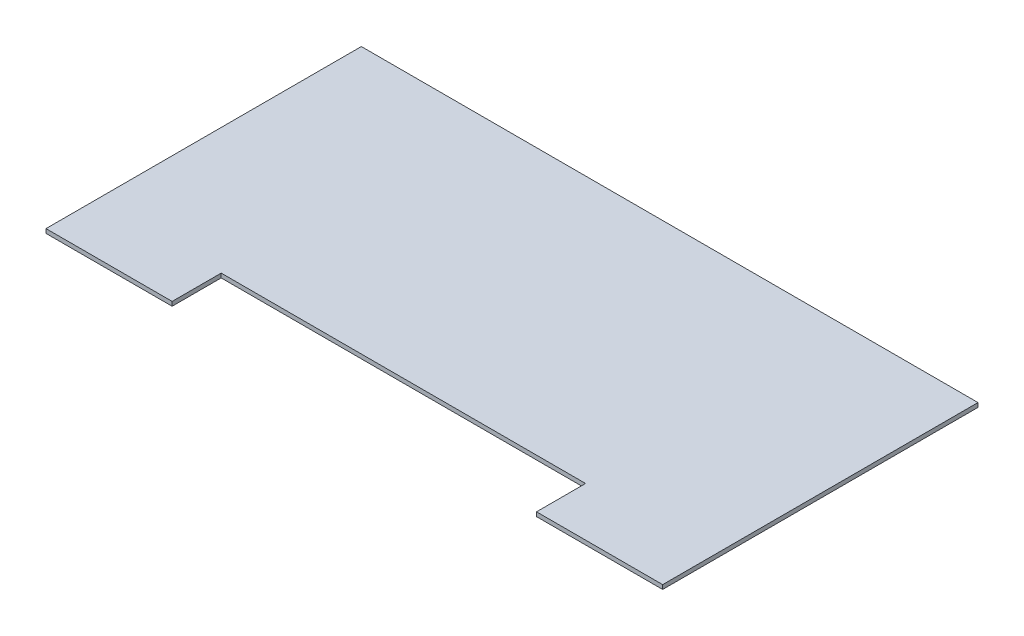
ISO-10303-21;
HEADER;
FILE_DESCRIPTION(('STEP AP214'),'2;1');
FILE_NAME('part.step','',(''),(''),'','','');
FILE_SCHEMA(('AUTOMOTIVE_DESIGN { 1 0 10303 214 1 1 1 1 }'));
ENDSEC;
DATA;
#1=APPLICATION_CONTEXT('core data for automotive mechanical design processes');
#2=APPLICATION_PROTOCOL_DEFINITION('international standard','automotive_design',2000,#1);
#3=PRODUCT_CONTEXT('',#1,'mechanical');
#4=PRODUCT('Part','Part','',(#3));
#5=PRODUCT_RELATED_PRODUCT_CATEGORY('part','',(#4));
#6=PRODUCT_DEFINITION_FORMATION('','',#4);
#7=PRODUCT_DEFINITION_CONTEXT('part definition',#1,'design');
#8=PRODUCT_DEFINITION('design','',#6,#7);
#9=PRODUCT_DEFINITION_SHAPE('','',#8);
#10=(LENGTH_UNIT() NAMED_UNIT(*) SI_UNIT(.MILLI.,.METRE.));
#11=(NAMED_UNIT(*) PLANE_ANGLE_UNIT() SI_UNIT($,.RADIAN.));
#12=(NAMED_UNIT(*) SI_UNIT($,.STERADIAN.) SOLID_ANGLE_UNIT());
#13=UNCERTAINTY_MEASURE_WITH_UNIT(LENGTH_MEASURE(1.E-05),#10,'distance_accuracy_value','');
#14=(GEOMETRIC_REPRESENTATION_CONTEXT(3) GLOBAL_UNCERTAINTY_ASSIGNED_CONTEXT((#13)) GLOBAL_UNIT_ASSIGNED_CONTEXT((#10,
#11,#12)) REPRESENTATION_CONTEXT('',''));
#15=CARTESIAN_POINT('',(0.,0.,0.));
#16=DIRECTION('',(0.,0.,1.));
#17=DIRECTION('',(1.,0.,0.));
#18=AXIS2_PLACEMENT_3D('',#15,#16,#17);
#19=CARTESIAN_POINT('',(0.,164.,0.));
#20=DIRECTION('',(0.,0.,1.));
#21=DIRECTION('',(1.,0.,0.));
#22=AXIS2_PLACEMENT_3D('',#19,#20,#21);
#23=PLANE('',#22);
#24=DIRECTION('',(0.,1.,0.));
#25=VECTOR('',#24,1.);
#26=CARTESIAN_POINT('',(350.,-3.001,0.));
#27=LINE('',#26,#25);
#28=CARTESIAN_POINT('',(350.,164.,0.));
#29=VERTEX_POINT('',#28);
#30=CARTESIAN_POINT('',(350.,167.,0.));
#31=VERTEX_POINT('',#30);
#32=EDGE_CURVE('E121',#29,#31,#27,.T.);
#33=ORIENTED_EDGE('',*,*,#32,.F.);
#34=DIRECTION('',(1.,0.,0.));
#35=VECTOR('',#34,1.);
#36=CARTESIAN_POINT('',(0.,164.,0.));
#37=LINE('',#36,#35);
#38=CARTESIAN_POINT('',(439.999999999999,164.,0.));
#39=VERTEX_POINT('',#38);
#40=EDGE_CURVE('E126',#29,#39,#37,.T.);
#41=ORIENTED_EDGE('',*,*,#40,.T.);
#42=DIRECTION('',(0.,1.,0.));
#43=VECTOR('',#42,1.);
#44=CARTESIAN_POINT('',(439.999999999999,164.,0.));
#45=LINE('',#44,#43);
#46=CARTESIAN_POINT('',(439.999999999999,167.,0.));
#47=VERTEX_POINT('',#46);
#48=EDGE_CURVE('E161',#39,#47,#45,.T.);
#49=ORIENTED_EDGE('',*,*,#48,.T.);
#50=DIRECTION('',(1.,0.,0.));
#51=VECTOR('',#50,1.);
#52=CARTESIAN_POINT('',(0.,167.,0.));
#53=LINE('',#52,#51);
#54=EDGE_CURVE('E152',#31,#47,#53,.T.);
#55=ORIENTED_EDGE('',*,*,#54,.F.);
#56=EDGE_LOOP('',(#33,#41,#49,#55));
#57=FACE_BOUND('',#56,.T.);
#58=ADVANCED_FACE('F32',(#57),#23,.T.);
#59=CARTESIAN_POINT('',(0.,164.,-225.));
#60=DIRECTION('',(-1.,0.,0.));
#61=DIRECTION('',(0.,0.,1.));
#62=AXIS2_PLACEMENT_3D('',#59,#60,#61);
#63=PLANE('',#62);
#64=DIRECTION('',(0.,0.,1.));
#65=VECTOR('',#64,1.);
#66=CARTESIAN_POINT('',(0.,167.,-225.));
#67=LINE('',#66,#65);
#68=CARTESIAN_POINT('',(0.,167.,-225.));
#69=VERTEX_POINT('',#68);
#70=CARTESIAN_POINT('',(0.,167.,0.));
#71=VERTEX_POINT('',#70);
#72=EDGE_CURVE('E120',#69,#71,#67,.T.);
#73=ORIENTED_EDGE('',*,*,#72,.F.);
#74=DIRECTION('',(0.,1.,0.));
#75=VECTOR('',#74,1.);
#76=CARTESIAN_POINT('',(0.,164.,-225.));
#77=LINE('',#76,#75);
#78=CARTESIAN_POINT('',(0.,164.,-225.));
#79=VERTEX_POINT('',#78);
#80=EDGE_CURVE('E11',#79,#69,#77,.T.);
#81=ORIENTED_EDGE('',*,*,#80,.F.);
#82=DIRECTION('',(0.,0.,1.));
#83=VECTOR('',#82,1.);
#84=CARTESIAN_POINT('',(0.,164.,-225.));
#85=LINE('',#84,#83);
#86=CARTESIAN_POINT('',(0.,164.,0.));
#87=VERTEX_POINT('',#86);
#88=EDGE_CURVE('E140',#79,#87,#85,.T.);
#89=ORIENTED_EDGE('',*,*,#88,.T.);
#90=DIRECTION('',(0.,1.,0.));
#91=VECTOR('',#90,1.);
#92=CARTESIAN_POINT('',(0.,164.,0.));
#93=LINE('',#92,#91);
#94=EDGE_CURVE('E36',#87,#71,#93,.T.);
#95=ORIENTED_EDGE('',*,*,#94,.T.);
#96=EDGE_LOOP('',(#73,#81,#89,#95));
#97=FACE_BOUND('',#96,.T.);
#98=ADVANCED_FACE('F34',(#97),#63,.T.);
#99=CARTESIAN_POINT('',(0.,164.,-225.));
#100=DIRECTION('',(0.,0.,-1.));
#101=DIRECTION('',(-1.,0.,0.));
#102=AXIS2_PLACEMENT_3D('',#99,#100,#101);
#103=PLANE('',#102);
#104=DIRECTION('',(-1.,0.,0.));
#105=VECTOR('',#104,1.);
#106=CARTESIAN_POINT('',(0.,167.,-225.));
#107=LINE('',#106,#105);
#108=CARTESIAN_POINT('',(439.999999999999,167.,-225.));
#109=VERTEX_POINT('',#108);
#110=EDGE_CURVE('E142',#109,#69,#107,.T.);
#111=ORIENTED_EDGE('',*,*,#110,.F.);
#112=DIRECTION('',(0.,1.,0.));
#113=VECTOR('',#112,1.);
#114=CARTESIAN_POINT('',(439.999999999999,164.,-225.));
#115=LINE('',#114,#113);
#116=CARTESIAN_POINT('',(439.999999999999,164.,-225.));
#117=VERTEX_POINT('',#116);
#118=EDGE_CURVE('E41',#117,#109,#115,.T.);
#119=ORIENTED_EDGE('',*,*,#118,.F.);
#120=DIRECTION('',(-1.,0.,0.));
#121=VECTOR('',#120,1.);
#122=CARTESIAN_POINT('',(0.,164.,-225.));
#123=LINE('',#122,#121);
#124=EDGE_CURVE('E148',#117,#79,#123,.T.);
#125=ORIENTED_EDGE('',*,*,#124,.T.);
#126=ORIENTED_EDGE('',*,*,#80,.T.);
#127=EDGE_LOOP('',(#111,#119,#125,#126));
#128=FACE_BOUND('',#127,.T.);
#129=ADVANCED_FACE('F171',(#128),#103,.T.);
#130=CARTESIAN_POINT('',(439.999999999999,164.,-225.));
#131=DIRECTION('',(1.,0.,0.));
#132=DIRECTION('',(0.,0.,-1.));
#133=AXIS2_PLACEMENT_3D('',#130,#131,#132);
#134=PLANE('',#133);
#135=DIRECTION('',(0.,0.,-1.));
#136=VECTOR('',#135,1.);
#137=CARTESIAN_POINT('',(439.999999999999,167.,-225.));
#138=LINE('',#137,#136);
#139=EDGE_CURVE('E156',#47,#109,#138,.T.);
#140=ORIENTED_EDGE('',*,*,#139,.F.);
#141=ORIENTED_EDGE('',*,*,#48,.F.);
#142=DIRECTION('',(0.,0.,-1.));
#143=VECTOR('',#142,1.);
#144=CARTESIAN_POINT('',(439.999999999999,164.,-225.));
#145=LINE('',#144,#143);
#146=EDGE_CURVE('E145',#39,#117,#145,.T.);
#147=ORIENTED_EDGE('',*,*,#146,.T.);
#148=ORIENTED_EDGE('',*,*,#118,.T.);
#149=EDGE_LOOP('',(#140,#141,#147,#148));
#150=FACE_BOUND('',#149,.T.);
#151=ADVANCED_FACE('F174',(#150),#134,.T.);
#152=DIRECTION('',(0.,1.,0.));
#153=VECTOR('',#152,1.);
#154=CARTESIAN_POINT('',(89.9999999999997,-3.001,0.));
#155=LINE('',#154,#153);
#156=CARTESIAN_POINT('',(89.9999999999997,164.,0.));
#157=VERTEX_POINT('',#156);
#158=CARTESIAN_POINT('',(89.9999999999997,167.,0.));
#159=VERTEX_POINT('',#158);
#160=EDGE_CURVE('E136',#157,#159,#155,.T.);
#161=ORIENTED_EDGE('',*,*,#160,.T.);
#162=EDGE_CURVE('E153',#71,#159,#53,.T.);
#163=ORIENTED_EDGE('',*,*,#162,.F.);
#164=ORIENTED_EDGE('',*,*,#94,.F.);
#165=EDGE_CURVE('E143',#87,#157,#37,.T.);
#166=ORIENTED_EDGE('',*,*,#165,.T.);
#167=EDGE_LOOP('',(#161,#163,#164,#166));
#168=FACE_BOUND('',#167,.T.);
#169=ADVANCED_FACE('F167',(#168),#23,.T.);
#170=CARTESIAN_POINT('',(0.,164.,0.));
#171=DIRECTION('',(0.,1.,0.));
#172=DIRECTION('',(0.,0.,1.));
#173=AXIS2_PLACEMENT_3D('',#170,#171,#172);
#174=PLANE('',#173);
#175=ORIENTED_EDGE('',*,*,#40,.F.);
#176=DIRECTION('',(0.,0.,1.));
#177=VECTOR('',#176,1.);
#178=CARTESIAN_POINT('',(350.,164.,0.));
#179=LINE('',#178,#177);
#180=CARTESIAN_POINT('',(350.,164.,-35.));
#181=VERTEX_POINT('',#180);
#182=EDGE_CURVE('E106',#181,#29,#179,.T.);
#183=ORIENTED_EDGE('',*,*,#182,.F.);
#184=DIRECTION('',(1.,0.,0.));
#185=VECTOR('',#184,1.);
#186=CARTESIAN_POINT('',(89.9999999999997,164.,-35.));
#187=LINE('',#186,#185);
#188=CARTESIAN_POINT('',(89.9999999999997,164.,-35.));
#189=VERTEX_POINT('',#188);
#190=EDGE_CURVE('E115',#189,#181,#187,.T.);
#191=ORIENTED_EDGE('',*,*,#190,.F.);
#192=DIRECTION('',(0.,0.,-1.));
#193=VECTOR('',#192,1.);
#194=CARTESIAN_POINT('',(89.9999999999997,164.,0.));
#195=LINE('',#194,#193);
#196=EDGE_CURVE('E127',#157,#189,#195,.T.);
#197=ORIENTED_EDGE('',*,*,#196,.F.);
#198=ORIENTED_EDGE('',*,*,#165,.F.);
#199=ORIENTED_EDGE('',*,*,#88,.F.);
#200=ORIENTED_EDGE('',*,*,#124,.F.);
#201=ORIENTED_EDGE('',*,*,#146,.F.);
#202=EDGE_LOOP('',(#175,#183,#191,#197,#198,#199,#200,#201));
#203=FACE_BOUND('',#202,.T.);
#204=ADVANCED_FACE('F124',(#203),#174,.F.);
#205=CARTESIAN_POINT('',(0.,167.,0.));
#206=DIRECTION('',(0.,1.,0.));
#207=DIRECTION('',(0.,0.,1.));
#208=AXIS2_PLACEMENT_3D('',#205,#206,#207);
#209=PLANE('',#208);
#210=DIRECTION('',(0.,0.,-1.));
#211=VECTOR('',#210,1.);
#212=CARTESIAN_POINT('',(350.,167.,0.));
#213=LINE('',#212,#211);
#214=CARTESIAN_POINT('',(350.,167.,-35.));
#215=VERTEX_POINT('',#214);
#216=EDGE_CURVE('E49',#31,#215,#213,.T.);
#217=ORIENTED_EDGE('',*,*,#216,.F.);
#218=ORIENTED_EDGE('',*,*,#54,.T.);
#219=ORIENTED_EDGE('',*,*,#139,.T.);
#220=ORIENTED_EDGE('',*,*,#110,.T.);
#221=ORIENTED_EDGE('',*,*,#72,.T.);
#222=ORIENTED_EDGE('',*,*,#162,.T.);
#223=DIRECTION('',(0.,0.,1.));
#224=VECTOR('',#223,1.);
#225=CARTESIAN_POINT('',(89.9999999999997,167.,0.));
#226=LINE('',#225,#224);
#227=CARTESIAN_POINT('',(89.9999999999997,167.,-35.));
#228=VERTEX_POINT('',#227);
#229=EDGE_CURVE('E112',#228,#159,#226,.T.);
#230=ORIENTED_EDGE('',*,*,#229,.F.);
#231=DIRECTION('',(-1.,0.,0.));
#232=VECTOR('',#231,1.);
#233=CARTESIAN_POINT('',(89.9999999999997,167.,-35.));
#234=LINE('',#233,#232);
#235=EDGE_CURVE('E129',#215,#228,#234,.T.);
#236=ORIENTED_EDGE('',*,*,#235,.F.);
#237=EDGE_LOOP('',(#217,#218,#219,#220,#221,#222,#230,#236));
#238=FACE_BOUND('',#237,.T.);
#239=ADVANCED_FACE('F170',(#238),#209,.T.);
#240=CARTESIAN_POINT('',(350.,-3.001,0.));
#241=DIRECTION('',(1.,0.,0.));
#242=DIRECTION('',(0.,0.,-1.));
#243=AXIS2_PLACEMENT_3D('',#240,#241,#242);
#244=PLANE('',#243);
#245=ORIENTED_EDGE('',*,*,#182,.T.);
#246=ORIENTED_EDGE('',*,*,#32,.T.);
#247=ORIENTED_EDGE('',*,*,#216,.T.);
#248=DIRECTION('',(0.,1.,0.));
#249=VECTOR('',#248,1.);
#250=CARTESIAN_POINT('',(350.,-3.001,-35.));
#251=LINE('',#250,#249);
#252=EDGE_CURVE('E102',#181,#215,#251,.T.);
#253=ORIENTED_EDGE('',*,*,#252,.F.);
#254=EDGE_LOOP('',(#245,#246,#247,#253));
#255=FACE_BOUND('',#254,.T.);
#256=ADVANCED_FACE('F104',(#255),#244,.F.);
#257=CARTESIAN_POINT('',(89.9999999999997,-3.001,0.));
#258=DIRECTION('',(-1.,0.,0.));
#259=DIRECTION('',(0.,0.,1.));
#260=AXIS2_PLACEMENT_3D('',#257,#258,#259);
#261=PLANE('',#260);
#262=ORIENTED_EDGE('',*,*,#196,.T.);
#263=DIRECTION('',(0.,1.,0.));
#264=VECTOR('',#263,1.);
#265=CARTESIAN_POINT('',(89.9999999999997,-3.001,-35.));
#266=LINE('',#265,#264);
#267=EDGE_CURVE('E111',#189,#228,#266,.T.);
#268=ORIENTED_EDGE('',*,*,#267,.T.);
#269=ORIENTED_EDGE('',*,*,#229,.T.);
#270=ORIENTED_EDGE('',*,*,#160,.F.);
#271=EDGE_LOOP('',(#262,#268,#269,#270));
#272=FACE_BOUND('',#271,.T.);
#273=ADVANCED_FACE('F176',(#272),#261,.F.);
#274=CARTESIAN_POINT('',(89.9999999999997,-3.001,-35.));
#275=DIRECTION('',(0.,0.,-1.));
#276=DIRECTION('',(-1.,0.,0.));
#277=AXIS2_PLACEMENT_3D('',#274,#275,#276);
#278=PLANE('',#277);
#279=ORIENTED_EDGE('',*,*,#190,.T.);
#280=ORIENTED_EDGE('',*,*,#252,.T.);
#281=ORIENTED_EDGE('',*,*,#235,.T.);
#282=ORIENTED_EDGE('',*,*,#267,.F.);
#283=EDGE_LOOP('',(#279,#280,#281,#282));
#284=FACE_BOUND('',#283,.T.);
#285=ADVANCED_FACE('F116',(#284),#278,.F.);
#286=CLOSED_SHELL('',(#58,#98,#129,#151,#169,#204,#239,#256,#273,#285));
#287=MANIFOLD_SOLID_BREP('B2',#286);
#288=ADVANCED_BREP_SHAPE_REPRESENTATION('',(#18,#287),#14);
#289=SHAPE_DEFINITION_REPRESENTATION(#9,#288);
ENDSEC;
END-ISO-10303-21;
